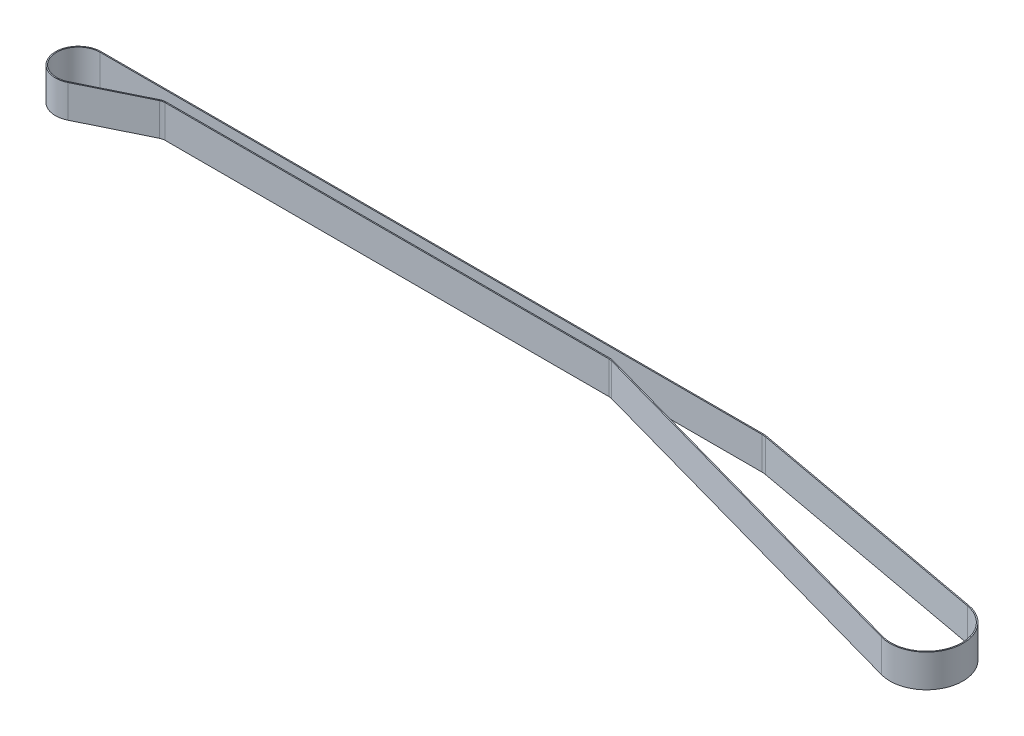
ISO-10303-21;
HEADER;
FILE_DESCRIPTION(('STEP AP214'),'2;1');
FILE_NAME('part.step','',(''),(''),'','','');
FILE_SCHEMA(('AUTOMOTIVE_DESIGN { 1 0 10303 214 1 1 1 1 }'));
ENDSEC;
DATA;
#1=APPLICATION_CONTEXT('core data for automotive mechanical design processes');
#2=APPLICATION_PROTOCOL_DEFINITION('international standard','automotive_design',2000,#1);
#3=PRODUCT_CONTEXT('',#1,'mechanical');
#4=PRODUCT('Part','Part','',(#3));
#5=PRODUCT_RELATED_PRODUCT_CATEGORY('part','',(#4));
#6=PRODUCT_DEFINITION_FORMATION('','',#4);
#7=PRODUCT_DEFINITION_CONTEXT('part definition',#1,'design');
#8=PRODUCT_DEFINITION('design','',#6,#7);
#9=PRODUCT_DEFINITION_SHAPE('','',#8);
#10=(LENGTH_UNIT() NAMED_UNIT(*) SI_UNIT(.MILLI.,.METRE.));
#11=(NAMED_UNIT(*) PLANE_ANGLE_UNIT() SI_UNIT($,.RADIAN.));
#12=(NAMED_UNIT(*) SI_UNIT($,.STERADIAN.) SOLID_ANGLE_UNIT());
#13=UNCERTAINTY_MEASURE_WITH_UNIT(LENGTH_MEASURE(1.E-05),#10,'distance_accuracy_value','');
#14=(GEOMETRIC_REPRESENTATION_CONTEXT(3) GLOBAL_UNCERTAINTY_ASSIGNED_CONTEXT((#13)) GLOBAL_UNIT_ASSIGNED_CONTEXT((#10,
#11,#12)) REPRESENTATION_CONTEXT('',''));
#15=CARTESIAN_POINT('',(0.,0.,0.));
#16=DIRECTION('',(0.,0.,1.));
#17=DIRECTION('',(1.,0.,0.));
#18=AXIS2_PLACEMENT_3D('',#15,#16,#17);
#19=CARTESIAN_POINT('',(59.2953552271843,15.,-213.006409594298));
#20=DIRECTION('',(0.2681766781917,0.,-0.963369746916554));
#21=DIRECTION('',(-0.963369746916554,0.,-0.2681766781917));
#22=AXIS2_PLACEMENT_3D('',#19,#20,#21);
#23=PLANE('',#22);
#24=DIRECTION('',(0.963369746916554,0.,0.2681766781917));
#25=VECTOR('',#24,1.);
#26=CARTESIAN_POINT('',(59.2953552271843,0.,-213.006409594298));
#27=LINE('',#26,#25);
#28=CARTESIAN_POINT('',(-658.891051676478,0.,-412.930525482629));
#29=VERTEX_POINT('',#28);
#30=CARTESIAN_POINT('',(-487.045817139292,0.,-365.09335360884));
#31=VERTEX_POINT('',#30);
#32=EDGE_CURVE('E243',#29,#31,#27,.T.);
#33=ORIENTED_EDGE('',*,*,#32,.F.);
#34=DIRECTION('',(0.,-1.,0.));
#35=VECTOR('',#34,1.);
#36=CARTESIAN_POINT('',(-658.891051676478,15.,-412.930525482629));
#37=LINE('',#36,#35);
#38=CARTESIAN_POINT('',(-658.891051676478,15.,-412.930525482629));
#39=VERTEX_POINT('',#38);
#40=EDGE_CURVE('E11',#39,#29,#37,.T.);
#41=ORIENTED_EDGE('',*,*,#40,.F.);
#42=DIRECTION('',(0.963369746916554,0.,0.2681766781917));
#43=VECTOR('',#42,1.);
#44=CARTESIAN_POINT('',(59.2953552271843,15.,-213.006409594298));
#45=LINE('',#44,#43);
#46=CARTESIAN_POINT('',(-487.045817139292,15.,-365.09335360884));
#47=VERTEX_POINT('',#46);
#48=EDGE_CURVE('E376',#39,#47,#45,.T.);
#49=ORIENTED_EDGE('',*,*,#48,.T.);
#50=DIRECTION('',(0.,-1.,0.));
#51=VECTOR('',#50,1.);
#52=CARTESIAN_POINT('',(-487.045817139292,15.,-365.09335360884));
#53=LINE('',#52,#51);
#54=EDGE_CURVE('E54',#47,#31,#53,.T.);
#55=ORIENTED_EDGE('',*,*,#54,.T.);
#56=EDGE_LOOP('',(#33,#41,#49,#55));
#57=FACE_BOUND('',#56,.T.);
#58=ADVANCED_FACE('F33',(#57),#23,.T.);
#59=CARTESIAN_POINT('',(-660.36600542839,15.,-407.632056457378));
#60=DIRECTION('',(0.,-1.,0.));
#61=DIRECTION('',(0.,0.,-1.));
#62=AXIS2_PLACEMENT_3D('',#59,#60,#61);
#63=CYLINDRICAL_SURFACE('',#62,5.49993296157583);
#64=CARTESIAN_POINT('',(-660.36600542839,0.,-407.632056457378));
#65=DIRECTION('',(0.,1.,0.));
#66=DIRECTION('',(0.,0.,1.));
#67=AXIS2_PLACEMENT_3D('',#64,#65,#66);
#68=CIRCLE('',#67,5.49993296157583);
#69=CARTESIAN_POINT('',(-660.366014040917,0.,-413.131989418947));
#70=VERTEX_POINT('',#69);
#71=EDGE_CURVE('E245',#29,#70,#68,.T.);
#72=ORIENTED_EDGE('',*,*,#71,.T.);
#73=DIRECTION('',(0.,-1.,0.));
#74=VECTOR('',#73,1.);
#75=CARTESIAN_POINT('',(-660.366014040917,15.,-413.131989418947));
#76=LINE('',#75,#74);
#77=CARTESIAN_POINT('',(-660.366014040917,15.,-413.131989418947));
#78=VERTEX_POINT('',#77);
#79=EDGE_CURVE('E45',#78,#70,#76,.T.);
#80=ORIENTED_EDGE('',*,*,#79,.F.);
#81=CARTESIAN_POINT('',(-660.36600542839,15.,-407.632056457378));
#82=DIRECTION('',(0.,1.,0.));
#83=DIRECTION('',(0.,0.,1.));
#84=AXIS2_PLACEMENT_3D('',#81,#82,#83);
#85=CIRCLE('',#84,5.49993296157583);
#86=EDGE_CURVE('E379',#39,#78,#85,.T.);
#87=ORIENTED_EDGE('',*,*,#86,.F.);
#88=ORIENTED_EDGE('',*,*,#40,.T.);
#89=EDGE_LOOP('',(#72,#80,#87,#88));
#90=FACE_BOUND('',#89,.T.);
#91=ADVANCED_FACE('F343',(#90),#63,.T.);
#92=CARTESIAN_POINT('',(0.,15.,-413.131989418947));
#93=DIRECTION('',(0.,0.,1.));
#94=DIRECTION('',(1.,0.,0.));
#95=AXIS2_PLACEMENT_3D('',#92,#93,#94);
#96=PLANE('',#95);
#97=DIRECTION('',(-1.,0.,0.));
#98=VECTOR('',#97,1.);
#99=CARTESIAN_POINT('',(0.,0.,-413.131989418947));
#100=LINE('',#99,#98);
#101=CARTESIAN_POINT('',(-864.195127300779,0.,-413.131989418947));
#102=VERTEX_POINT('',#101);
#103=EDGE_CURVE('E248',#70,#102,#100,.T.);
#104=ORIENTED_EDGE('',*,*,#103,.T.);
#105=DIRECTION('',(0.,-1.,0.));
#106=VECTOR('',#105,1.);
#107=CARTESIAN_POINT('',(-864.195127300779,15.,-413.131989418947));
#108=LINE('',#107,#106);
#109=CARTESIAN_POINT('',(-864.195127300779,15.,-413.131989418947));
#110=VERTEX_POINT('',#109);
#111=EDGE_CURVE('E279',#110,#102,#108,.T.);
#112=ORIENTED_EDGE('',*,*,#111,.F.);
#113=DIRECTION('',(-1.,0.,0.));
#114=VECTOR('',#113,1.);
#115=CARTESIAN_POINT('',(0.,15.,-413.131989418947));
#116=LINE('',#115,#114);
#117=EDGE_CURVE('E387',#78,#110,#116,.T.);
#118=ORIENTED_EDGE('',*,*,#117,.F.);
#119=ORIENTED_EDGE('',*,*,#79,.T.);
#120=EDGE_LOOP('',(#104,#112,#118,#119));
#121=FACE_BOUND('',#120,.T.);
#122=ADVANCED_FACE('F348',(#121),#96,.F.);
#123=CARTESIAN_POINT('',(-864.195127300779,15.,-407.631989419066));
#124=DIRECTION('',(0.,-1.,0.));
#125=DIRECTION('',(0.,0.,-1.));
#126=AXIS2_PLACEMENT_3D('',#123,#124,#125);
#127=CYLINDRICAL_SURFACE('',#126,5.49999999988095);
#128=CARTESIAN_POINT('',(-864.195127300779,0.,-407.631989419066));
#129=DIRECTION('',(0.,1.,0.));
#130=DIRECTION('',(0.,0.,1.));
#131=AXIS2_PLACEMENT_3D('',#128,#129,#130);
#132=CIRCLE('',#131,5.49999999988095);
#133=CARTESIAN_POINT('',(-866.614701830206,0.,-412.571185618372));
#134=VERTEX_POINT('',#133);
#135=EDGE_CURVE('E251',#102,#134,#132,.T.);
#136=ORIENTED_EDGE('',*,*,#135,.T.);
#137=DIRECTION('',(0.,-1.,0.));
#138=VECTOR('',#137,1.);
#139=CARTESIAN_POINT('',(-866.614701830206,15.,-412.571185618372));
#140=LINE('',#139,#138);
#141=CARTESIAN_POINT('',(-866.614701830206,15.,-412.571185618372));
#142=VERTEX_POINT('',#141);
#143=EDGE_CURVE('E277',#142,#134,#140,.T.);
#144=ORIENTED_EDGE('',*,*,#143,.F.);
#145=CARTESIAN_POINT('',(-864.195127300779,15.,-407.631989419066));
#146=DIRECTION('',(0.,1.,0.));
#147=DIRECTION('',(0.,0.,1.));
#148=AXIS2_PLACEMENT_3D('',#145,#146,#147);
#149=CIRCLE('',#148,5.49999999988095);
#150=EDGE_CURVE('E390',#110,#142,#149,.T.);
#151=ORIENTED_EDGE('',*,*,#150,.F.);
#152=ORIENTED_EDGE('',*,*,#111,.T.);
#153=EDGE_LOOP('',(#136,#144,#151,#152));
#154=FACE_BOUND('',#153,.T.);
#155=ADVANCED_FACE('F420',(#154),#127,.T.);
#156=CARTESIAN_POINT('',(-330.710557455445,15.,-675.09568669529));
#157=DIRECTION('',(-0.439922641723596,0.,-0.898035672620488));
#158=DIRECTION('',(-0.898035672620488,0.,0.439922641723596));
#159=AXIS2_PLACEMENT_3D('',#156,#157,#158);
#160=PLANE('',#159);
#161=DIRECTION('',(0.898035672620488,0.,-0.439922641723596));
#162=VECTOR('',#161,1.);
#163=CARTESIAN_POINT('',(-330.710557455445,0.,-675.09568669529));
#164=LINE('',#163,#162);
#165=CARTESIAN_POINT('',(-894.79590088349,0.,-398.766001801695));
#166=VERTEX_POINT('',#165);
#167=EDGE_CURVE('E254',#166,#134,#164,.T.);
#168=ORIENTED_EDGE('',*,*,#167,.F.);
#169=DIRECTION('',(0.,-1.,0.));
#170=VECTOR('',#169,1.);
#171=CARTESIAN_POINT('',(-894.79590088349,15.,-398.766001801695));
#172=LINE('',#171,#170);
#173=CARTESIAN_POINT('',(-894.79590088349,15.,-398.766001801695));
#174=VERTEX_POINT('',#173);
#175=EDGE_CURVE('E275',#174,#166,#172,.T.);
#176=ORIENTED_EDGE('',*,*,#175,.F.);
#177=DIRECTION('',(0.898035672620488,0.,-0.439922641723596));
#178=VECTOR('',#177,1.);
#179=CARTESIAN_POINT('',(-330.710557455445,15.,-675.09568669529));
#180=LINE('',#179,#178);
#181=EDGE_CURVE('E392',#174,#142,#180,.T.);
#182=ORIENTED_EDGE('',*,*,#181,.T.);
#183=ORIENTED_EDGE('',*,*,#143,.T.);
#184=EDGE_LOOP('',(#168,#176,#182,#183));
#185=FACE_BOUND('',#184,.T.);
#186=ADVANCED_FACE('F404',(#185),#160,.T.);
#187=CARTESIAN_POINT('',(-899.195127300676,15.,-407.746358527798));
#188=DIRECTION('',(0.,-1.,0.));
#189=DIRECTION('',(0.,0.,-1.));
#190=AXIS2_PLACEMENT_3D('',#187,#188,#189);
#191=CYLINDRICAL_SURFACE('',#190,9.99999999988657);
#192=CARTESIAN_POINT('',(-899.195127300676,0.,-407.746358527798));
#193=DIRECTION('',(0.,1.,0.));
#194=DIRECTION('',(0.,0.,1.));
#195=AXIS2_PLACEMENT_3D('',#192,#193,#194);
#196=CIRCLE('',#195,9.99999999988657);
#197=CARTESIAN_POINT('',(-899.195127300676,0.,-417.746358527684));
#198=VERTEX_POINT('',#197);
#199=EDGE_CURVE('E257',#198,#166,#196,.T.);
#200=ORIENTED_EDGE('',*,*,#199,.F.);
#201=DIRECTION('',(0.,-1.,0.));
#202=VECTOR('',#201,1.);
#203=CARTESIAN_POINT('',(-899.195127300676,15.,-417.746358527684));
#204=LINE('',#203,#202);
#205=CARTESIAN_POINT('',(-899.195127300676,15.,-417.746358527684));
#206=VERTEX_POINT('',#205);
#207=EDGE_CURVE('E273',#206,#198,#204,.T.);
#208=ORIENTED_EDGE('',*,*,#207,.F.);
#209=CARTESIAN_POINT('',(-899.195127300676,15.,-407.746358527798));
#210=DIRECTION('',(0.,1.,0.));
#211=DIRECTION('',(0.,0.,1.));
#212=AXIS2_PLACEMENT_3D('',#209,#210,#211);
#213=CIRCLE('',#212,9.99999999988657);
#214=EDGE_CURVE('E395',#206,#174,#213,.T.);
#215=ORIENTED_EDGE('',*,*,#214,.T.);
#216=ORIENTED_EDGE('',*,*,#175,.T.);
#217=EDGE_LOOP('',(#200,#208,#215,#216));
#218=FACE_BOUND('',#217,.T.);
#219=ADVANCED_FACE('F399',(#218),#191,.F.);
#220=CARTESIAN_POINT('',(0.00140759406048733,15.,-417.743328667924));
#221=DIRECTION('',(3.36951894592259E-06,0.,-0.999999999994323));
#222=DIRECTION('',(-0.999999999994323,0.,-3.36951894592259E-06));
#223=AXIS2_PLACEMENT_3D('',#220,#221,#222);
#224=PLANE('',#223);
#225=DIRECTION('',(0.999999999994323,0.,3.36951894592259E-06));
#226=VECTOR('',#225,1.);
#227=CARTESIAN_POINT('',(0.00140759406048733,0.,-417.743328667924));
#228=LINE('',#227,#226);
#229=CARTESIAN_POINT('',(-595.213886711287,0.,-417.745334257135));
#230=VERTEX_POINT('',#229);
#231=EDGE_CURVE('E260',#198,#230,#228,.T.);
#232=ORIENTED_EDGE('',*,*,#231,.T.);
#233=DIRECTION('',(0.,-1.,0.));
#234=VECTOR('',#233,1.);
#235=CARTESIAN_POINT('',(-595.213886711287,15.,-417.745334257135));
#236=LINE('',#235,#234);
#237=CARTESIAN_POINT('',(-595.213886711287,15.,-417.745334257135));
#238=VERTEX_POINT('',#237);
#239=EDGE_CURVE('E189',#238,#230,#236,.T.);
#240=ORIENTED_EDGE('',*,*,#239,.F.);
#241=DIRECTION('',(0.999999999994323,0.,3.36951894592259E-06));
#242=VECTOR('',#241,1.);
#243=CARTESIAN_POINT('',(0.00140759406048733,15.,-417.743328667924));
#244=LINE('',#243,#242);
#245=EDGE_CURVE('E199',#206,#238,#244,.T.);
#246=ORIENTED_EDGE('',*,*,#245,.F.);
#247=ORIENTED_EDGE('',*,*,#207,.T.);
#248=EDGE_LOOP('',(#232,#240,#246,#247));
#249=FACE_BOUND('',#248,.T.);
#250=ADVANCED_FACE('F407',(#249),#224,.F.);
#251=CARTESIAN_POINT('',(-595.213920413322,15.,-407.744318369717));
#252=DIRECTION('',(0.,-1.,0.));
#253=DIRECTION('',(0.,0.,-1.));
#254=AXIS2_PLACEMENT_3D('',#251,#252,#253);
#255=CYLINDRICAL_SURFACE('',#254,10.0010158874751);
#256=CARTESIAN_POINT('',(-595.213920413322,0.,-407.744318369717));
#257=DIRECTION('',(0.,1.,0.));
#258=DIRECTION('',(0.,0.,1.));
#259=AXIS2_PLACEMENT_3D('',#256,#257,#258);
#260=CIRCLE('',#259,10.0010158874751);
#261=CARTESIAN_POINT('',(-593.409278239394,0.,-417.581166716906));
#262=VERTEX_POINT('',#261);
#263=EDGE_CURVE('E185',#262,#230,#260,.T.);
#264=ORIENTED_EDGE('',*,*,#263,.F.);
#265=DIRECTION('',(0.,-1.,0.));
#266=VECTOR('',#265,1.);
#267=CARTESIAN_POINT('',(-593.409278239394,15.,-417.581166716906));
#268=LINE('',#267,#266);
#269=CARTESIAN_POINT('',(-593.409278239394,15.,-417.581166716906));
#270=VERTEX_POINT('',#269);
#271=EDGE_CURVE('E180',#270,#262,#268,.T.);
#272=ORIENTED_EDGE('',*,*,#271,.F.);
#273=CARTESIAN_POINT('',(-595.213920413322,15.,-407.744318369717));
#274=DIRECTION('',(0.,1.,0.));
#275=DIRECTION('',(0.,0.,1.));
#276=AXIS2_PLACEMENT_3D('',#273,#274,#275);
#277=CIRCLE('',#276,10.0010158874751);
#278=EDGE_CURVE('E183',#270,#238,#277,.T.);
#279=ORIENTED_EDGE('',*,*,#278,.T.);
#280=ORIENTED_EDGE('',*,*,#239,.T.);
#281=EDGE_LOOP('',(#264,#272,#279,#280));
#282=FACE_BOUND('',#281,.T.);
#283=ADVANCED_FACE('F182',(#282),#255,.F.);
#284=CARTESIAN_POINT('',(54.7920816410144,15.,-298.663860080621));
#285=DIRECTION('',(-0.180445886121196,0.,0.983584913559544));
#286=DIRECTION('',(0.983584913559544,0.,0.180445886121196));
#287=AXIS2_PLACEMENT_3D('',#284,#285,#286);
#288=PLANE('',#287);
#289=DIRECTION('',(-0.983584913559544,0.,-0.180445886121196));
#290=VECTOR('',#289,1.);
#291=CARTESIAN_POINT('',(54.7920816410144,0.,-298.663860080621));
#292=LINE('',#291,#290);
#293=CARTESIAN_POINT('',(-479.91163032089,0.,-396.759188493177));
#294=VERTEX_POINT('',#293);
#295=EDGE_CURVE('E264',#294,#262,#292,.T.);
#296=ORIENTED_EDGE('',*,*,#295,.F.);
#297=DIRECTION('',(0.,-1.,0.));
#298=VECTOR('',#297,1.);
#299=CARTESIAN_POINT('',(-479.91163032089,15.,-396.759188493177));
#300=LINE('',#299,#298);
#301=CARTESIAN_POINT('',(-479.91163032089,15.,-396.759188493177));
#302=VERTEX_POINT('',#301);
#303=EDGE_CURVE('E115',#302,#294,#300,.T.);
#304=ORIENTED_EDGE('',*,*,#303,.F.);
#305=DIRECTION('',(-0.983584913559544,0.,-0.180445886121196));
#306=VECTOR('',#305,1.);
#307=CARTESIAN_POINT('',(54.7920816410144,15.,-298.663860080621));
#308=LINE('',#307,#306);
#309=EDGE_CURVE('E196',#302,#270,#308,.T.);
#310=ORIENTED_EDGE('',*,*,#309,.T.);
#311=ORIENTED_EDGE('',*,*,#271,.T.);
#312=EDGE_LOOP('',(#296,#304,#310,#311));
#313=FACE_BOUND('',#312,.T.);
#314=ADVANCED_FACE('F202',(#313),#288,.T.);
#315=CARTESIAN_POINT('',(-660.36600542839,15.,-407.632056457378));
#316=DIRECTION('',(0.,-1.,0.));
#317=DIRECTION('',(0.,0.,-1.));
#318=AXIS2_PLACEMENT_3D('',#315,#316,#317);
#319=CYLINDRICAL_SURFACE('',#318,5.00000000000003);
#320=CARTESIAN_POINT('',(-660.36600542839,0.,-407.632056457378));
#321=DIRECTION('',(0.,1.,0.));
#322=DIRECTION('',(0.,0.,1.));
#323=AXIS2_PLACEMENT_3D('',#320,#321,#322);
#324=CIRCLE('',#323,5.00000000000003);
#325=CARTESIAN_POINT('',(-659.025122037432,0.,-412.448905191961));
#326=VERTEX_POINT('',#325);
#327=CARTESIAN_POINT('',(-660.36600542839,0.,-412.632056457378));
#328=VERTEX_POINT('',#327);
#329=EDGE_CURVE('E209',#326,#328,#324,.T.);
#330=ORIENTED_EDGE('',*,*,#329,.F.);
#331=DIRECTION('',(0.,-1.,0.));
#332=VECTOR('',#331,1.);
#333=CARTESIAN_POINT('',(-659.025122037432,15.,-412.448905191961));
#334=LINE('',#333,#332);
#335=CARTESIAN_POINT('',(-659.025122037432,15.,-412.448905191961));
#336=VERTEX_POINT('',#335);
#337=EDGE_CURVE('E127',#336,#326,#334,.T.);
#338=ORIENTED_EDGE('',*,*,#337,.F.);
#339=CARTESIAN_POINT('',(-660.36600542839,15.,-407.632056457378));
#340=DIRECTION('',(0.,1.,0.));
#341=DIRECTION('',(0.,0.,1.));
#342=AXIS2_PLACEMENT_3D('',#339,#340,#341);
#343=CIRCLE('',#342,5.00000000000003);
#344=CARTESIAN_POINT('',(-660.36600542839,15.,-412.632056457378));
#345=VERTEX_POINT('',#344);
#346=EDGE_CURVE('E269',#336,#345,#343,.T.);
#347=ORIENTED_EDGE('',*,*,#346,.T.);
#348=DIRECTION('',(0.,-1.,0.));
#349=VECTOR('',#348,1.);
#350=CARTESIAN_POINT('',(-660.36600542839,15.,-412.632056457378));
#351=LINE('',#350,#349);
#352=EDGE_CURVE('E205',#345,#328,#351,.T.);
#353=ORIENTED_EDGE('',*,*,#352,.T.);
#354=EDGE_LOOP('',(#330,#338,#347,#353));
#355=FACE_BOUND('',#354,.T.);
#356=ADVANCED_FACE('F35',(#355),#319,.F.);
#357=CARTESIAN_POINT('',(59.1612848662304,15.,-212.524789303629));
#358=DIRECTION('',(-0.268176678191701,0.,0.963369746916554));
#359=DIRECTION('',(0.963369746916554,0.,0.268176678191701));
#360=AXIS2_PLACEMENT_3D('',#357,#358,#359);
#361=PLANE('',#360);
#362=DIRECTION('',(-0.963369746916554,0.,-0.268176678191701));
#363=VECTOR('',#362,1.);
#364=CARTESIAN_POINT('',(59.1612848662304,0.,-212.524789303629));
#365=LINE('',#364,#363);
#366=CARTESIAN_POINT('',(-487.166106804967,0.,-364.607897136793));
#367=VERTEX_POINT('',#366);
#368=EDGE_CURVE('E212',#367,#326,#365,.T.);
#369=ORIENTED_EDGE('',*,*,#368,.F.);
#370=DIRECTION('',(0.,-1.,0.));
#371=VECTOR('',#370,1.);
#372=CARTESIAN_POINT('',(-487.166106804967,15.,-364.607897136793));
#373=LINE('',#372,#371);
#374=CARTESIAN_POINT('',(-487.166106804967,15.,-364.607897136793));
#375=VERTEX_POINT('',#374);
#376=EDGE_CURVE('E298',#375,#367,#373,.T.);
#377=ORIENTED_EDGE('',*,*,#376,.F.);
#378=DIRECTION('',(-0.963369746916554,0.,-0.268176678191701));
#379=VECTOR('',#378,1.);
#380=CARTESIAN_POINT('',(59.1612848662304,15.,-212.524789303629));
#381=LINE('',#380,#379);
#382=EDGE_CURVE('E565',#375,#336,#381,.T.);
#383=ORIENTED_EDGE('',*,*,#382,.T.);
#384=ORIENTED_EDGE('',*,*,#337,.T.);
#385=EDGE_LOOP('',(#369,#377,#383,#384));
#386=FACE_BOUND('',#385,.T.);
#387=ADVANCED_FACE('F334',(#386),#361,.T.);
#388=CARTESIAN_POINT('',(-482.674152964122,15.,-380.744320572251));
#389=DIRECTION('',(0.,-1.,0.));
#390=DIRECTION('',(0.,0.,-1.));
#391=AXIS2_PLACEMENT_3D('',#388,#389,#390);
#392=CYLINDRICAL_SURFACE('',#391,16.7499794207834);
#393=CARTESIAN_POINT('',(-482.674152964122,0.,-380.744320572251));
#394=DIRECTION('',(0.,1.,0.));
#395=DIRECTION('',(0.,0.,1.));
#396=AXIS2_PLACEMENT_3D('',#393,#394,#395);
#397=CIRCLE('',#396,16.7499794207834);
#398=CARTESIAN_POINT('',(-479.651763212386,0.,-397.219361415456));
#399=VERTEX_POINT('',#398);
#400=EDGE_CURVE('E215',#367,#399,#397,.T.);
#401=ORIENTED_EDGE('',*,*,#400,.T.);
#402=DIRECTION('',(0.,-1.,0.));
#403=VECTOR('',#402,1.);
#404=CARTESIAN_POINT('',(-479.651763212386,15.,-397.219361415456));
#405=LINE('',#404,#403);
#406=CARTESIAN_POINT('',(-479.651763212386,15.,-397.219361415456));
#407=VERTEX_POINT('',#406);
#408=EDGE_CURVE('E296',#407,#399,#405,.T.);
#409=ORIENTED_EDGE('',*,*,#408,.F.);
#410=CARTESIAN_POINT('',(-482.674152964122,15.,-380.744320572251));
#411=DIRECTION('',(0.,1.,0.));
#412=DIRECTION('',(0.,0.,1.));
#413=AXIS2_PLACEMENT_3D('',#410,#411,#412);
#414=CIRCLE('',#413,16.7499794207834);
#415=EDGE_CURVE('E568',#375,#407,#414,.T.);
#416=ORIENTED_EDGE('',*,*,#415,.F.);
#417=ORIENTED_EDGE('',*,*,#376,.T.);
#418=EDGE_LOOP('',(#401,#409,#416,#417));
#419=FACE_BOUND('',#418,.T.);
#420=ADVANCED_FACE('F331',(#419),#392,.T.);
#421=CARTESIAN_POINT('',(54.8812993612868,15.,-299.157859434219));
#422=DIRECTION('',(0.180441400900237,0.,-0.983585736395745));
#423=DIRECTION('',(-0.983585736395745,0.,-0.180441400900237));
#424=AXIS2_PLACEMENT_3D('',#421,#422,#423);
#425=PLANE('',#424);
#426=DIRECTION('',(0.983585736395745,0.,0.180441400900237));
#427=VECTOR('',#426,1.);
#428=CARTESIAN_POINT('',(54.8812993612868,0.,-299.157859434219));
#429=LINE('',#428,#427);
#430=CARTESIAN_POINT('',(-593.319285703869,0.,-418.071968601872));
#431=VERTEX_POINT('',#430);
#432=EDGE_CURVE('E218',#431,#399,#429,.T.);
#433=ORIENTED_EDGE('',*,*,#432,.F.);
#434=DIRECTION('',(0.,-1.,0.));
#435=VECTOR('',#434,1.);
#436=CARTESIAN_POINT('',(-593.319285703869,15.,-418.071968601872));
#437=LINE('',#436,#435);
#438=CARTESIAN_POINT('',(-593.319285703869,15.,-418.071968601872));
#439=VERTEX_POINT('',#438);
#440=EDGE_CURVE('E294',#439,#431,#437,.T.);
#441=ORIENTED_EDGE('',*,*,#440,.F.);
#442=DIRECTION('',(0.983585736395745,0.,0.180441400900237));
#443=VECTOR('',#442,1.);
#444=CARTESIAN_POINT('',(54.8812993612868,15.,-299.157859434219));
#445=LINE('',#444,#443);
#446=EDGE_CURVE('E570',#439,#407,#445,.T.);
#447=ORIENTED_EDGE('',*,*,#446,.T.);
#448=ORIENTED_EDGE('',*,*,#408,.T.);
#449=EDGE_LOOP('',(#433,#441,#447,#448));
#450=FACE_BOUND('',#449,.T.);
#451=ADVANCED_FACE('F327',(#450),#425,.T.);
#452=CARTESIAN_POINT('',(-595.213920413322,15.,-407.744318369717));
#453=DIRECTION('',(0.,-1.,0.));
#454=DIRECTION('',(0.,0.,-1.));
#455=AXIS2_PLACEMENT_3D('',#452,#453,#454);
#456=CYLINDRICAL_SURFACE('',#455,10.5);
#457=CARTESIAN_POINT('',(-595.213920413322,0.,-407.744318369717));
#458=DIRECTION('',(0.,1.,0.));
#459=DIRECTION('',(0.,0.,1.));
#460=AXIS2_PLACEMENT_3D('',#457,#458,#459);
#461=CIRCLE('',#460,10.5);
#462=CARTESIAN_POINT('',(-595.213920413322,0.,-418.244318369717));
#463=VERTEX_POINT('',#462);
#464=EDGE_CURVE('E221',#431,#463,#461,.T.);
#465=ORIENTED_EDGE('',*,*,#464,.T.);
#466=DIRECTION('',(0.,-1.,0.));
#467=VECTOR('',#466,1.);
#468=CARTESIAN_POINT('',(-595.213920413322,15.,-418.244318369717));
#469=LINE('',#468,#467);
#470=CARTESIAN_POINT('',(-595.213920413322,15.,-418.244318369717));
#471=VERTEX_POINT('',#470);
#472=EDGE_CURVE('E292',#471,#463,#469,.T.);
#473=ORIENTED_EDGE('',*,*,#472,.F.);
#474=CARTESIAN_POINT('',(-595.213920413322,15.,-407.744318369717));
#475=DIRECTION('',(0.,1.,0.));
#476=DIRECTION('',(0.,0.,1.));
#477=AXIS2_PLACEMENT_3D('',#474,#475,#476);
#478=CIRCLE('',#477,10.5);
#479=EDGE_CURVE('E575',#439,#471,#478,.T.);
#480=ORIENTED_EDGE('',*,*,#479,.F.);
#481=ORIENTED_EDGE('',*,*,#440,.T.);
#482=EDGE_LOOP('',(#465,#473,#480,#481));
#483=FACE_BOUND('',#482,.T.);
#484=ADVANCED_FACE('F323',(#483),#456,.T.);
#485=CARTESIAN_POINT('',(0.00281813325432042,15.,-418.240307756552));
#486=DIRECTION('',(6.73807187397352E-06,0.,-0.999999999977299));
#487=DIRECTION('',(-0.999999999977299,0.,-6.73807187397352E-06));
#488=AXIS2_PLACEMENT_3D('',#485,#486,#487);
#489=PLANE('',#488);
#490=DIRECTION('',(0.999999999977299,0.,6.73807187397352E-06));
#491=VECTOR('',#490,1.);
#492=CARTESIAN_POINT('',(0.00281813325432042,0.,-418.240307756552));
#493=LINE('',#492,#491);
#494=CARTESIAN_POINT('',(-899.195069047354,0.,-418.246366616544));
#495=VERTEX_POINT('',#494);
#496=EDGE_CURVE('E224',#495,#463,#493,.T.);
#497=ORIENTED_EDGE('',*,*,#496,.F.);
#498=CARTESIAN_POINT('',(-899.195069047354,15.,-418.246366616524));
#499=DIRECTION('',(0.,-1.,0.));
#500=VECTOR('',#499,1.);
#501=LINE('',#498,#500);
#502=CARTESIAN_POINT('',(-899.195069047354,15.,-418.246366616544));
#503=VERTEX_POINT('',#502);
#504=EDGE_CURVE('E291',#503,#495,#501,.T.);
#505=ORIENTED_EDGE('',*,*,#504,.F.);
#506=DIRECTION('',(0.999999999977299,0.,6.73807187397352E-06));
#507=VECTOR('',#506,1.);
#508=CARTESIAN_POINT('',(0.00281813325432042,15.,-418.240307756552));
#509=LINE('',#508,#507);
#510=EDGE_CURVE('E577',#503,#471,#509,.T.);
#511=ORIENTED_EDGE('',*,*,#510,.T.);
#512=ORIENTED_EDGE('',*,*,#472,.T.);
#513=EDGE_LOOP('',(#497,#505,#511,#512));
#514=FACE_BOUND('',#513,.T.);
#515=ADVANCED_FACE('F318',(#514),#489,.T.);
#516=CARTESIAN_POINT('',(-899.195118880831,15.,-407.746366616642));
#517=DIRECTION('',(0.,-1.,0.));
#518=DIRECTION('',(0.,0.,-1.));
#519=AXIS2_PLACEMENT_3D('',#516,#517,#518);
#520=CYLINDRICAL_SURFACE('',#519,10.5000000000001);
#521=CARTESIAN_POINT('',(-899.195118880831,0.,-407.746366616642));
#522=DIRECTION('',(0.,1.,0.));
#523=DIRECTION('',(0.,0.,1.));
#524=AXIS2_PLACEMENT_3D('',#521,#522,#523);
#525=CIRCLE('',#524,10.5000000000001);
#526=CARTESIAN_POINT('',(-894.575915261066,0.,-398.316999834129));
#527=VERTEX_POINT('',#526);
#528=EDGE_CURVE('E227',#495,#527,#525,.T.);
#529=ORIENTED_EDGE('',*,*,#528,.T.);
#530=DIRECTION('',(0.,-1.,0.));
#531=VECTOR('',#530,1.);
#532=CARTESIAN_POINT('',(-894.575915261066,15.,-398.316999834129));
#533=LINE('',#532,#531);
#534=CARTESIAN_POINT('',(-894.575915261066,15.,-398.316999834129));
#535=VERTEX_POINT('',#534);
#536=EDGE_CURVE('E289',#535,#527,#533,.T.);
#537=ORIENTED_EDGE('',*,*,#536,.F.);
#538=CARTESIAN_POINT('',(-899.195118880831,15.,-407.746366616642));
#539=DIRECTION('',(0.,1.,0.));
#540=DIRECTION('',(0.,0.,1.));
#541=AXIS2_PLACEMENT_3D('',#538,#539,#540);
#542=CIRCLE('',#541,10.5000000000001);
#543=EDGE_CURVE('E580',#503,#535,#542,.T.);
#544=ORIENTED_EDGE('',*,*,#543,.F.);
#545=ORIENTED_EDGE('',*,*,#504,.T.);
#546=EDGE_LOOP('',(#529,#537,#544,#545));
#547=FACE_BOUND('',#546,.T.);
#548=ADVANCED_FACE('F308',(#547),#520,.T.);
#549=CARTESIAN_POINT('',(-330.492199408398,15.,-674.647065491281));
#550=DIRECTION('',(0.43992415426332,0.,0.898034931667863));
#551=DIRECTION('',(0.898034931667863,0.,-0.43992415426332));
#552=AXIS2_PLACEMENT_3D('',#549,#550,#551);
#553=PLANE('',#552);
#554=DIRECTION('',(-0.898034931667863,0.,0.43992415426332));
#555=VECTOR('',#554,1.);
#556=CARTESIAN_POINT('',(-330.492199408398,0.,-674.647065491281));
#557=LINE('',#556,#555);
#558=CARTESIAN_POINT('',(-866.394739459569,0.,-412.122231115717));
#559=VERTEX_POINT('',#558);
#560=EDGE_CURVE('E232',#559,#527,#557,.T.);
#561=ORIENTED_EDGE('',*,*,#560,.F.);
#562=DIRECTION('',(0.,-1.,0.));
#563=VECTOR('',#562,1.);
#564=CARTESIAN_POINT('',(-866.394739459569,15.,-412.122231115717));
#565=LINE('',#564,#563);
#566=CARTESIAN_POINT('',(-866.394739459569,15.,-412.122231115717));
#567=VERTEX_POINT('',#566);
#568=EDGE_CURVE('E287',#567,#559,#565,.T.);
#569=ORIENTED_EDGE('',*,*,#568,.F.);
#570=DIRECTION('',(-0.898034931667863,0.,0.43992415426332));
#571=VECTOR('',#570,1.);
#572=CARTESIAN_POINT('',(-330.492199408398,15.,-674.647065491281));
#573=LINE('',#572,#571);
#574=EDGE_CURVE('E381',#567,#535,#573,.T.);
#575=ORIENTED_EDGE('',*,*,#574,.T.);
#576=ORIENTED_EDGE('',*,*,#536,.T.);
#577=EDGE_LOOP('',(#561,#569,#575,#576));
#578=FACE_BOUND('',#577,.T.);
#579=ADVANCED_FACE('F317',(#578),#553,.T.);
#580=CARTESIAN_POINT('',(-864.195118688252,15.,-407.632056457378));
#581=DIRECTION('',(0.,-1.,0.));
#582=DIRECTION('',(0.,0.,-1.));
#583=AXIS2_PLACEMENT_3D('',#580,#581,#582);
#584=CYLINDRICAL_SURFACE('',#583,5.00000000000005);
#585=CARTESIAN_POINT('',(-864.195118688252,0.,-407.632056457378));
#586=DIRECTION('',(0.,1.,0.));
#587=DIRECTION('',(0.,0.,1.));
#588=AXIS2_PLACEMENT_3D('',#585,#586,#587);
#589=CIRCLE('',#588,5.00000000000005);
#590=CARTESIAN_POINT('',(-864.195118688252,0.,-412.632056457378));
#591=VERTEX_POINT('',#590);
#592=EDGE_CURVE('E237',#591,#559,#589,.T.);
#593=ORIENTED_EDGE('',*,*,#592,.F.);
#594=DIRECTION('',(0.,-1.,0.));
#595=VECTOR('',#594,1.);
#596=CARTESIAN_POINT('',(-864.195118688252,15.,-412.632056457378));
#597=LINE('',#596,#595);
#598=CARTESIAN_POINT('',(-864.195118688252,15.,-412.632056457378));
#599=VERTEX_POINT('',#598);
#600=EDGE_CURVE('E285',#599,#591,#597,.T.);
#601=ORIENTED_EDGE('',*,*,#600,.F.);
#602=CARTESIAN_POINT('',(-864.195118688252,15.,-407.632056457378));
#603=DIRECTION('',(0.,1.,0.));
#604=DIRECTION('',(0.,0.,1.));
#605=AXIS2_PLACEMENT_3D('',#602,#603,#604);
#606=CIRCLE('',#605,5.00000000000005);
#607=EDGE_CURVE('E377',#599,#567,#606,.T.);
#608=ORIENTED_EDGE('',*,*,#607,.T.);
#609=ORIENTED_EDGE('',*,*,#568,.T.);
#610=EDGE_LOOP('',(#593,#601,#608,#609));
#611=FACE_BOUND('',#610,.T.);
#612=ADVANCED_FACE('F356',(#611),#584,.F.);
#613=CARTESIAN_POINT('',(1.1237688337322E-13,15.,-412.632056457378));
#614=DIRECTION('',(0.,0.,1.));
#615=DIRECTION('',(1.,0.,0.));
#616=AXIS2_PLACEMENT_3D('',#613,#614,#615);
#617=PLANE('',#616);
#618=DIRECTION('',(-1.,0.,0.));
#619=VECTOR('',#618,1.);
#620=CARTESIAN_POINT('',(1.1237688337322E-13,0.,-412.632056457378));
#621=LINE('',#620,#619);
#622=EDGE_CURVE('E240',#328,#591,#621,.T.);
#623=ORIENTED_EDGE('',*,*,#622,.F.);
#624=ORIENTED_EDGE('',*,*,#352,.F.);
#625=DIRECTION('',(-1.,0.,0.));
#626=VECTOR('',#625,1.);
#627=CARTESIAN_POINT('',(1.1237688337322E-13,15.,-412.632056457378));
#628=LINE('',#627,#626);
#629=EDGE_CURVE('E374',#345,#599,#628,.T.);
#630=ORIENTED_EDGE('',*,*,#629,.T.);
#631=ORIENTED_EDGE('',*,*,#600,.T.);
#632=EDGE_LOOP('',(#623,#624,#630,#631));
#633=FACE_BOUND('',#632,.T.);
#634=ADVANCED_FACE('F353',(#633),#617,.T.);
#635=CARTESIAN_POINT('',(-482.687946118676,15.,-380.748111996234));
#636=DIRECTION('',(0.,-1.,0.));
#637=DIRECTION('',(0.,0.,-1.));
#638=AXIS2_PLACEMENT_3D('',#635,#636,#637);
#639=CYLINDRICAL_SURFACE('',#638,16.25);
#640=CARTESIAN_POINT('',(-482.687946118676,0.,-380.748111996234));
#641=DIRECTION('',(0.,1.,0.));
#642=DIRECTION('',(0.,0.,1.));
#643=AXIS2_PLACEMENT_3D('',#640,#641,#642);
#644=CIRCLE('',#643,16.25);
#645=EDGE_CURVE('E266',#31,#294,#644,.T.);
#646=ORIENTED_EDGE('',*,*,#645,.F.);
#647=ORIENTED_EDGE('',*,*,#54,.F.);
#648=CARTESIAN_POINT('',(-482.687946118676,15.,-380.748111996234));
#649=DIRECTION('',(0.,1.,0.));
#650=DIRECTION('',(0.,0.,1.));
#651=AXIS2_PLACEMENT_3D('',#648,#649,#650);
#652=CIRCLE('',#651,16.25);
#653=EDGE_CURVE('E203',#47,#302,#652,.T.);
#654=ORIENTED_EDGE('',*,*,#653,.T.);
#655=ORIENTED_EDGE('',*,*,#303,.T.);
#656=EDGE_LOOP('',(#646,#647,#654,#655));
#657=FACE_BOUND('',#656,.T.);
#658=ADVANCED_FACE('F355',(#657),#639,.F.);
#659=CARTESIAN_POINT('',(0.,15.,0.));
#660=DIRECTION('',(0.,1.,0.));
#661=DIRECTION('',(0.,0.,1.));
#662=AXIS2_PLACEMENT_3D('',#659,#660,#661);
#663=PLANE('',#662);
#664=ORIENTED_EDGE('',*,*,#346,.F.);
#665=ORIENTED_EDGE('',*,*,#382,.F.);
#666=ORIENTED_EDGE('',*,*,#415,.T.);
#667=ORIENTED_EDGE('',*,*,#446,.F.);
#668=ORIENTED_EDGE('',*,*,#479,.T.);
#669=ORIENTED_EDGE('',*,*,#510,.F.);
#670=ORIENTED_EDGE('',*,*,#543,.T.);
#671=ORIENTED_EDGE('',*,*,#574,.F.);
#672=ORIENTED_EDGE('',*,*,#607,.F.);
#673=ORIENTED_EDGE('',*,*,#629,.F.);
#674=EDGE_LOOP('',(#664,#665,#666,#667,#668,#669,#670,#671,#672,#673));
#675=FACE_BOUND('',#674,.T.);
#676=ORIENTED_EDGE('',*,*,#48,.F.);
#677=ORIENTED_EDGE('',*,*,#86,.T.);
#678=ORIENTED_EDGE('',*,*,#117,.T.);
#679=ORIENTED_EDGE('',*,*,#150,.T.);
#680=ORIENTED_EDGE('',*,*,#181,.F.);
#681=ORIENTED_EDGE('',*,*,#214,.F.);
#682=ORIENTED_EDGE('',*,*,#245,.T.);
#683=ORIENTED_EDGE('',*,*,#278,.F.);
#684=ORIENTED_EDGE('',*,*,#309,.F.);
#685=ORIENTED_EDGE('',*,*,#653,.F.);
#686=EDGE_LOOP('',(#676,#677,#678,#679,#680,#681,#682,#683,#684,#685));
#687=FACE_BOUND('',#686,.T.);
#688=ADVANCED_FACE('F194',(#675,#687),#663,.T.);
#689=CARTESIAN_POINT('',(0.,0.,0.));
#690=DIRECTION('',(0.,1.,0.));
#691=DIRECTION('',(0.,0.,1.));
#692=AXIS2_PLACEMENT_3D('',#689,#690,#691);
#693=PLANE('',#692);
#694=ORIENTED_EDGE('',*,*,#329,.T.);
#695=ORIENTED_EDGE('',*,*,#622,.T.);
#696=ORIENTED_EDGE('',*,*,#592,.T.);
#697=ORIENTED_EDGE('',*,*,#560,.T.);
#698=ORIENTED_EDGE('',*,*,#528,.F.);
#699=ORIENTED_EDGE('',*,*,#496,.T.);
#700=ORIENTED_EDGE('',*,*,#464,.F.);
#701=ORIENTED_EDGE('',*,*,#432,.T.);
#702=ORIENTED_EDGE('',*,*,#400,.F.);
#703=ORIENTED_EDGE('',*,*,#368,.T.);
#704=EDGE_LOOP('',(#694,#695,#696,#697,#698,#699,#700,#701,#702,#703));
#705=FACE_BOUND('',#704,.T.);
#706=ORIENTED_EDGE('',*,*,#32,.T.);
#707=ORIENTED_EDGE('',*,*,#645,.T.);
#708=ORIENTED_EDGE('',*,*,#295,.T.);
#709=ORIENTED_EDGE('',*,*,#263,.T.);
#710=ORIENTED_EDGE('',*,*,#231,.F.);
#711=ORIENTED_EDGE('',*,*,#199,.T.);
#712=ORIENTED_EDGE('',*,*,#167,.T.);
#713=ORIENTED_EDGE('',*,*,#135,.F.);
#714=ORIENTED_EDGE('',*,*,#103,.F.);
#715=ORIENTED_EDGE('',*,*,#71,.F.);
#716=EDGE_LOOP('',(#706,#707,#708,#709,#710,#711,#712,#713,#714,#715));
#717=FACE_BOUND('',#716,.T.);
#718=ADVANCED_FACE('F370',(#705,#717),#693,.F.);
#719=CLOSED_SHELL('',(#58,#91,#122,#155,#186,#219,#250,#283,#314,#356,#387,#420,#451,#484,#515,
#548,#579,#612,#634,#658,#688,#718));
#720=MANIFOLD_SOLID_BREP('B2',#719);
#721=ADVANCED_BREP_SHAPE_REPRESENTATION('',(#18,#720),#14);
#722=SHAPE_DEFINITION_REPRESENTATION(#9,#721);
ENDSEC;
END-ISO-10303-21;
